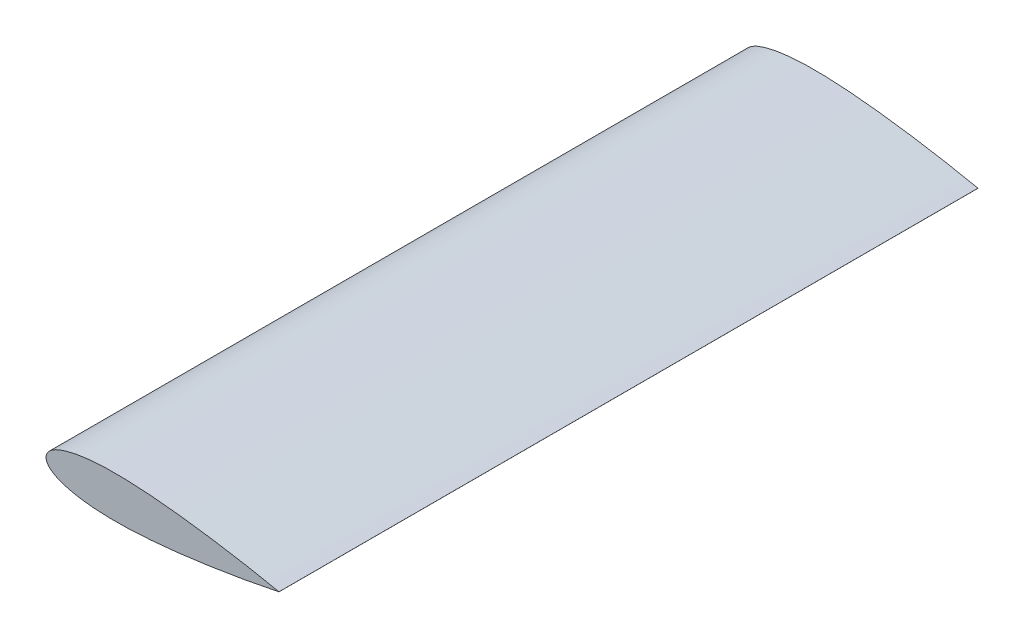
ISO-10303-21;
HEADER;
FILE_DESCRIPTION(('STEP AP214'),'2;1');
FILE_NAME('part.step','',(''),(''),'','','');
FILE_SCHEMA(('AUTOMOTIVE_DESIGN { 1 0 10303 214 1 1 1 1 }'));
ENDSEC;
DATA;
#1=APPLICATION_CONTEXT('core data for automotive mechanical design processes');
#2=APPLICATION_PROTOCOL_DEFINITION('international standard','automotive_design',2000,#1);
#3=PRODUCT_CONTEXT('',#1,'mechanical');
#4=PRODUCT('Part','Part','',(#3));
#5=PRODUCT_RELATED_PRODUCT_CATEGORY('part','',(#4));
#6=PRODUCT_DEFINITION_FORMATION('','',#4);
#7=PRODUCT_DEFINITION_CONTEXT('part definition',#1,'design');
#8=PRODUCT_DEFINITION('design','',#6,#7);
#9=PRODUCT_DEFINITION_SHAPE('','',#8);
#10=(LENGTH_UNIT() NAMED_UNIT(*) SI_UNIT(.MILLI.,.METRE.));
#11=(NAMED_UNIT(*) PLANE_ANGLE_UNIT() SI_UNIT($,.RADIAN.));
#12=(NAMED_UNIT(*) SI_UNIT($,.STERADIAN.) SOLID_ANGLE_UNIT());
#13=UNCERTAINTY_MEASURE_WITH_UNIT(LENGTH_MEASURE(1.E-05),#10,'distance_accuracy_value','');
#14=(GEOMETRIC_REPRESENTATION_CONTEXT(3) GLOBAL_UNCERTAINTY_ASSIGNED_CONTEXT((#13)) GLOBAL_UNIT_ASSIGNED_CONTEXT((#10,
#11,#12)) REPRESENTATION_CONTEXT('',''));
#15=CARTESIAN_POINT('',(0.,0.,0.));
#16=DIRECTION('',(0.,0.,1.));
#17=DIRECTION('',(1.,0.,0.));
#18=AXIS2_PLACEMENT_3D('',#15,#16,#17);
#19=CARTESIAN_POINT('',(200.,0.0260213051213717,600.));
#20=CARTESIAN_POINT('',(196.133660298478,0.824460006712465,600.));
#21=CARTESIAN_POINT('',(188.973100366724,2.3140297760843,600.));
#22=CARTESIAN_POINT('',(175.197231937674,4.95350611988753,600.));
#23=CARTESIAN_POINT('',(158.682087923264,7.86441699598787,600.));
#24=CARTESIAN_POINT('',(138.848303334329,10.9630350976696,600.));
#25=CARTESIAN_POINT('',(119.017582396932,13.6523870024844,600.));
#26=CARTESIAN_POINT('',(99.1865901628739,15.8519242763375,600.));
#27=CARTESIAN_POINT('',(79.3508231814695,17.4108328695893,600.));
#28=CARTESIAN_POINT('',(62.8015730614491,17.9645671230777,600.));
#29=CARTESIAN_POINT('',(49.5700590054438,17.7435664603347,600.));
#30=CARTESIAN_POINT('',(39.6383896206552,17.1554572660053,600.));
#31=CARTESIAN_POINT('',(29.6880483182081,16.0200037387892,600.));
#32=CARTESIAN_POINT('',(21.4064312661675,14.4333170095942,600.));
#33=CARTESIAN_POINT('',(14.8010946450581,12.5461964526299,600.));
#34=CARTESIAN_POINT('',(9.75689382971196,10.6396369380827,600.));
#35=CARTESIAN_POINT('',(5.53183474058884,8.34375260273691,600.));
#36=CARTESIAN_POINT('',(1.64540182435418,5.16826430599833,600.));
#37=CARTESIAN_POINT('',(-1.07371658677929,1.39068971727866E-10,600.));
#38=CARTESIAN_POINT('',(1.64540182414662,-5.16826430583284,600.));
#39=CARTESIAN_POINT('',(5.53183474024681,-8.34375260273153,600.));
#40=CARTESIAN_POINT('',(9.75689382927278,-10.6396369382518,600.));
#41=CARTESIAN_POINT('',(14.8010946445278,-12.5461964530085,600.));
#42=CARTESIAN_POINT('',(21.4064312655722,-14.4333170102454,600.));
#43=CARTESIAN_POINT('',(29.6880483175456,-16.0200037397817,600.));
#44=CARTESIAN_POINT('',(39.6383896199484,-17.1554572674104,600.));
#45=CARTESIAN_POINT('',(49.5700590047149,-17.7435664621512,600.));
#46=CARTESIAN_POINT('',(62.8015730607041,-17.9645671254425,600.));
#47=CARTESIAN_POINT('',(79.3508231807559,-17.4108328726382,600.));
#48=CARTESIAN_POINT('',(99.1865901622103,-15.8519242802048,600.));
#49=CARTESIAN_POINT('',(119.017582396365,-13.6523870071732,600.));
#50=CARTESIAN_POINT('',(138.848303333875,-10.9630351031778,600.));
#51=CARTESIAN_POINT('',(158.682087922939,-7.86441700231641,600.));
#52=CARTESIAN_POINT('',(175.19723193747,-4.95350612689835,600.));
#53=CARTESIAN_POINT('',(188.973100366629,-2.31402978366491,600.));
#54=CARTESIAN_POINT('',(196.133660298445,-0.824460014589041,600.));
#55=CARTESIAN_POINT('',(200.,-0.0260213131577581,600.));
#56=B_SPLINE_CURVE_WITH_KNOTS('',3,(#19,#20,#21,#22,#23,#24,#25,#26,#27,#28,#29,#30,#31,#32,#33,
#34,#35,#36,#37,#38,#39,#40,#41,#42,#43,#44,#45,#46,#47,#48,#49,#50,#51,#52,#53,#54,#55),
.UNSPECIFIED.,.F.,.F.,(4,1,1,1,1,1,1,1,1,1,1,1,1,1,1,1,1,1,1,1,1,1,1,1,1,1,1,1,1,1,1,1,1,1,4),
(-0.00418987500096905,0.0246038442030289,0.0491523591786544,0.0981086674933051,
0.146905311902654,0.195554796743804,0.244056276541371,0.292409554252618,0.340643731361213,
0.364754110742025,0.388905600274471,0.413178107881669,0.437756238827356,0.450304696837969,
0.463229878965421,0.477067953120696,0.485035558645787,0.5,0.514964441354213,0.522932046879304,
0.536770121034579,0.549695303162031,0.562243761172644,0.586821892118331,0.611094399725529,
0.635245889257975,0.659356268638787,0.707590445747382,0.755943723458629,0.804445203256196,
0.853094688097346,0.901891332506695,0.950847640821346,0.975396155796971,1.00418987500097),.UNSPECIFIED.);
#57=DIRECTION('',(0.,0.,-1.));
#58=VECTOR('',#57,1.);
#59=SURFACE_OF_LINEAR_EXTRUSION('',#56,#58);
#60=CARTESIAN_POINT('',(200.,0.0260213051213717,0.));
#61=CARTESIAN_POINT('',(196.133660298478,0.824460006712465,0.));
#62=CARTESIAN_POINT('',(188.973100366724,2.3140297760843,0.));
#63=CARTESIAN_POINT('',(175.197231937674,4.95350611988753,0.));
#64=CARTESIAN_POINT('',(158.682087923264,7.86441699598787,0.));
#65=CARTESIAN_POINT('',(138.848303334329,10.9630350976696,0.));
#66=CARTESIAN_POINT('',(119.017582396932,13.6523870024844,0.));
#67=CARTESIAN_POINT('',(99.1865901628739,15.8519242763375,0.));
#68=CARTESIAN_POINT('',(79.3508231814695,17.4108328695893,0.));
#69=CARTESIAN_POINT('',(62.8015730614491,17.9645671230777,0.));
#70=CARTESIAN_POINT('',(49.5700590054438,17.7435664603347,0.));
#71=CARTESIAN_POINT('',(39.6383896206552,17.1554572660053,0.));
#72=CARTESIAN_POINT('',(29.6880483182081,16.0200037387892,0.));
#73=CARTESIAN_POINT('',(21.4064312661675,14.4333170095942,0.));
#74=CARTESIAN_POINT('',(14.8010946450581,12.5461964526299,0.));
#75=CARTESIAN_POINT('',(9.75689382971196,10.6396369380827,0.));
#76=CARTESIAN_POINT('',(5.53183474058884,8.34375260273691,0.));
#77=CARTESIAN_POINT('',(1.64540182435418,5.16826430599833,0.));
#78=CARTESIAN_POINT('',(-1.07371658677929,1.39068971727866E-10,0.));
#79=CARTESIAN_POINT('',(1.64540182414662,-5.16826430583284,0.));
#80=CARTESIAN_POINT('',(5.53183474024681,-8.34375260273153,0.));
#81=CARTESIAN_POINT('',(9.75689382927278,-10.6396369382518,0.));
#82=CARTESIAN_POINT('',(14.8010946445278,-12.5461964530085,0.));
#83=CARTESIAN_POINT('',(21.4064312655722,-14.4333170102454,0.));
#84=CARTESIAN_POINT('',(29.6880483175456,-16.0200037397817,0.));
#85=CARTESIAN_POINT('',(39.6383896199484,-17.1554572674104,0.));
#86=CARTESIAN_POINT('',(49.5700590047149,-17.7435664621512,0.));
#87=CARTESIAN_POINT('',(62.8015730607041,-17.9645671254425,0.));
#88=CARTESIAN_POINT('',(79.3508231807559,-17.4108328726382,0.));
#89=CARTESIAN_POINT('',(99.1865901622103,-15.8519242802048,0.));
#90=CARTESIAN_POINT('',(119.017582396365,-13.6523870071732,0.));
#91=CARTESIAN_POINT('',(138.848303333875,-10.9630351031778,0.));
#92=CARTESIAN_POINT('',(158.682087922939,-7.86441700231641,0.));
#93=CARTESIAN_POINT('',(175.19723193747,-4.95350612689835,0.));
#94=CARTESIAN_POINT('',(188.973100366629,-2.31402978366491,0.));
#95=CARTESIAN_POINT('',(196.133660298445,-0.824460014589041,0.));
#96=CARTESIAN_POINT('',(200.,-0.0260213131577581,0.));
#97=B_SPLINE_CURVE_WITH_KNOTS('',3,(#60,#61,#62,#63,#64,#65,#66,#67,#68,#69,#70,#71,#72,#73,#74,
#75,#76,#77,#78,#79,#80,#81,#82,#83,#84,#85,#86,#87,#88,#89,#90,#91,#92,#93,#94,#95,#96),
.UNSPECIFIED.,.F.,.F.,(4,1,1,1,1,1,1,1,1,1,1,1,1,1,1,1,1,1,1,1,1,1,1,1,1,1,1,1,1,1,1,1,1,1,4),
(-0.00418987500096905,0.0246038442030289,0.0491523591786544,0.0981086674933051,
0.146905311902654,0.195554796743804,0.244056276541371,0.292409554252618,0.340643731361213,
0.364754110742025,0.388905600274471,0.413178107881669,0.437756238827356,0.450304696837969,
0.463229878965421,0.477067953120696,0.485035558645787,0.5,0.514964441354213,0.522932046879304,
0.536770121034579,0.549695303162031,0.562243761172644,0.586821892118331,0.611094399725529,
0.635245889257975,0.659356268638787,0.707590445747382,0.755943723458629,0.804445203256196,
0.853094688097346,0.901891332506695,0.950847640821346,0.975396155796971,1.00418987500097),.UNSPECIFIED.);
#98=CARTESIAN_POINT('',(200.,0.0260213051213717,0.));
#99=VERTEX_POINT('',#98);
#100=CARTESIAN_POINT('',(200.,-0.0260213131577581,0.));
#101=VERTEX_POINT('',#100);
#102=EDGE_CURVE('E61',#99,#101,#97,.T.);
#103=ORIENTED_EDGE('',*,*,#102,.T.);
#104=DIRECTION('',(0.,0.,-1.));
#105=VECTOR('',#104,1.);
#106=CARTESIAN_POINT('',(200.,-0.0260213131577581,600.));
#107=LINE('',#106,#105);
#108=CARTESIAN_POINT('',(200.,-0.0260213131577581,600.));
#109=VERTEX_POINT('',#108);
#110=EDGE_CURVE('E11',#109,#101,#107,.T.);
#111=ORIENTED_EDGE('',*,*,#110,.F.);
#112=CARTESIAN_POINT('',(200.,0.0260213051213717,600.));
#113=VERTEX_POINT('',#112);
#114=EDGE_CURVE('E63',#113,#109,#56,.T.);
#115=ORIENTED_EDGE('',*,*,#114,.F.);
#116=DIRECTION('',(0.,0.,-1.));
#117=VECTOR('',#116,1.);
#118=CARTESIAN_POINT('',(200.,0.0260213051213717,600.));
#119=LINE('',#118,#117);
#120=EDGE_CURVE('E45',#113,#99,#119,.T.);
#121=ORIENTED_EDGE('',*,*,#120,.T.);
#122=EDGE_LOOP('',(#103,#111,#115,#121));
#123=FACE_BOUND('',#122,.T.);
#124=ADVANCED_FACE('F36',(#123),#59,.F.);
#125=CARTESIAN_POINT('',(200.,0.0260213051213717,600.));
#126=DIRECTION('',(1.,0.,0.));
#127=DIRECTION('',(0.,0.,-1.));
#128=AXIS2_PLACEMENT_3D('',#125,#126,#127);
#129=PLANE('',#128);
#130=DIRECTION('',(0.,-1.,0.));
#131=VECTOR('',#130,1.);
#132=CARTESIAN_POINT('',(200.,0.0260213051213717,0.));
#133=LINE('',#132,#131);
#134=EDGE_CURVE('E68',#99,#101,#133,.T.);
#135=ORIENTED_EDGE('',*,*,#134,.F.);
#136=ORIENTED_EDGE('',*,*,#120,.F.);
#137=DIRECTION('',(0.,-1.,0.));
#138=VECTOR('',#137,1.);
#139=CARTESIAN_POINT('',(200.,0.0260213051213717,600.));
#140=LINE('',#139,#138);
#141=EDGE_CURVE('E65',#113,#109,#140,.T.);
#142=ORIENTED_EDGE('',*,*,#141,.T.);
#143=ORIENTED_EDGE('',*,*,#110,.T.);
#144=EDGE_LOOP('',(#135,#136,#142,#143));
#145=FACE_BOUND('',#144,.T.);
#146=ADVANCED_FACE('F70',(#145),#129,.T.);
#147=CARTESIAN_POINT('',(0.,1.16101526774034E-10,600.));
#148=DIRECTION('',(0.,0.,1.));
#149=DIRECTION('',(1.,0.,0.));
#150=AXIS2_PLACEMENT_3D('',#147,#148,#149);
#151=PLANE('',#150);
#152=ORIENTED_EDGE('',*,*,#114,.T.);
#153=ORIENTED_EDGE('',*,*,#141,.F.);
#154=EDGE_LOOP('',(#152,#153));
#155=FACE_BOUND('',#154,.T.);
#156=ADVANCED_FACE('F85',(#155),#151,.T.);
#157=CARTESIAN_POINT('',(0.,1.16101526774034E-10,0.));
#158=DIRECTION('',(0.,0.,1.));
#159=DIRECTION('',(1.,0.,0.));
#160=AXIS2_PLACEMENT_3D('',#157,#158,#159);
#161=PLANE('',#160);
#162=ORIENTED_EDGE('',*,*,#102,.F.);
#163=ORIENTED_EDGE('',*,*,#134,.T.);
#164=EDGE_LOOP('',(#162,#163));
#165=FACE_BOUND('',#164,.T.);
#166=ADVANCED_FACE('F67',(#165),#161,.F.);
#167=CLOSED_SHELL('',(#124,#146,#156,#166));
#168=MANIFOLD_SOLID_BREP('B2',#167);
#169=ADVANCED_BREP_SHAPE_REPRESENTATION('',(#18,#168),#14);
#170=SHAPE_DEFINITION_REPRESENTATION(#9,#169);
ENDSEC;
END-ISO-10303-21;
